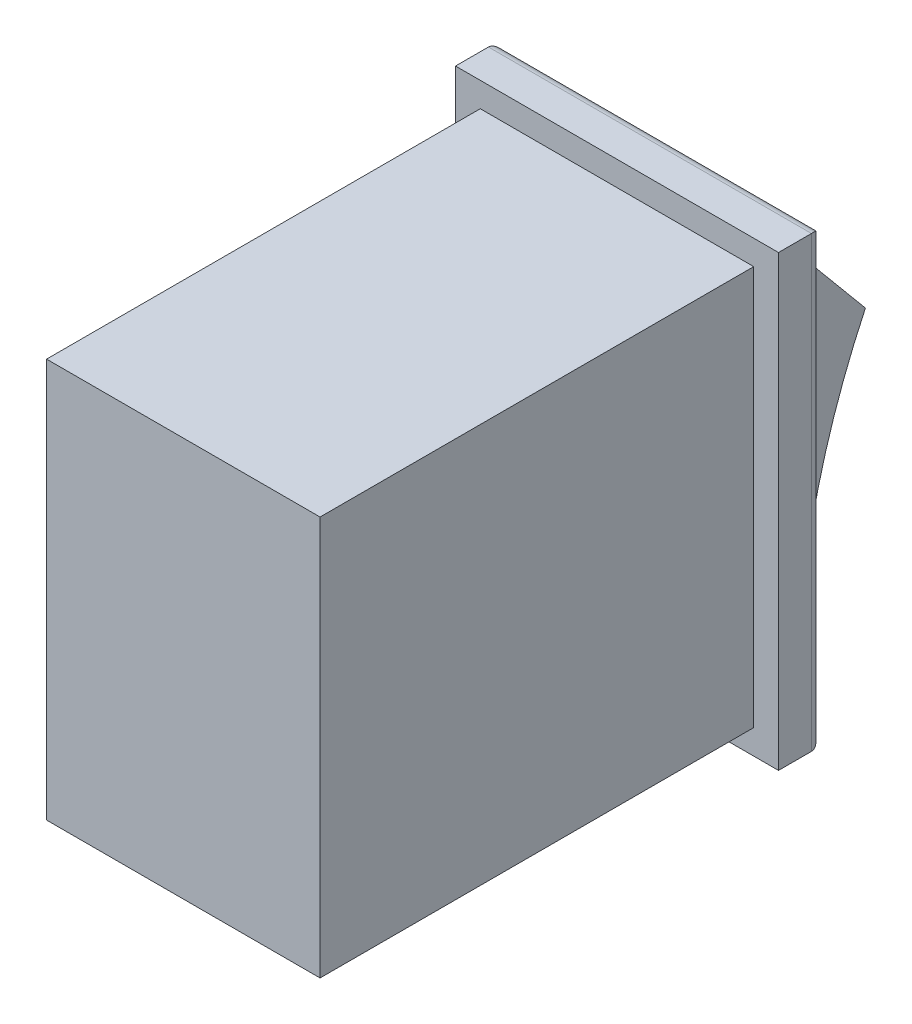
ISO-10303-21;
HEADER;
FILE_DESCRIPTION(('STEP AP214'),'2;1');
FILE_NAME('part.step','',(''),(''),'','','');
FILE_SCHEMA(('AUTOMOTIVE_DESIGN { 1 0 10303 214 1 1 1 1 }'));
ENDSEC;
DATA;
#1=APPLICATION_CONTEXT('core data for automotive mechanical design processes');
#2=APPLICATION_PROTOCOL_DEFINITION('international standard','automotive_design',2000,#1);
#3=PRODUCT_CONTEXT('',#1,'mechanical');
#4=PRODUCT('Part','Part','',(#3));
#5=PRODUCT_RELATED_PRODUCT_CATEGORY('part','',(#4));
#6=PRODUCT_DEFINITION_FORMATION('','',#4);
#7=PRODUCT_DEFINITION_CONTEXT('part definition',#1,'design');
#8=PRODUCT_DEFINITION('design','',#6,#7);
#9=PRODUCT_DEFINITION_SHAPE('','',#8);
#10=(LENGTH_UNIT() NAMED_UNIT(*) SI_UNIT(.MILLI.,.METRE.));
#11=(NAMED_UNIT(*) PLANE_ANGLE_UNIT() SI_UNIT($,.RADIAN.));
#12=(NAMED_UNIT(*) SI_UNIT($,.STERADIAN.) SOLID_ANGLE_UNIT());
#13=UNCERTAINTY_MEASURE_WITH_UNIT(LENGTH_MEASURE(1.E-05),#10,'distance_accuracy_value','');
#14=(GEOMETRIC_REPRESENTATION_CONTEXT(3) GLOBAL_UNCERTAINTY_ASSIGNED_CONTEXT((#13)) GLOBAL_UNIT_ASSIGNED_CONTEXT((#10,
#11,#12)) REPRESENTATION_CONTEXT('',''));
#15=CARTESIAN_POINT('',(0.,0.,0.));
#16=DIRECTION('',(0.,0.,1.));
#17=DIRECTION('',(1.,0.,0.));
#18=AXIS2_PLACEMENT_3D('',#15,#16,#17);
#19=CARTESIAN_POINT('',(13.85,-19.6875,-2.03));
#20=DIRECTION('',(0.,0.,-1.));
#21=DIRECTION('',(-1.,0.,0.));
#22=AXIS2_PLACEMENT_3D('',#19,#20,#21);
#23=PLANE('',#22);
#24=DIRECTION('',(0.,1.,0.));
#25=VECTOR('',#24,1.);
#26=CARTESIAN_POINT('',(-0.65,1.1425,-2.03));
#27=LINE('',#26,#25);
#28=CARTESIAN_POINT('',(-0.650000000000003,-19.1875,-2.03));
#29=VERTEX_POINT('',#28);
#30=CARTESIAN_POINT('',(-0.65,0.642500000000001,-2.03));
#31=VERTEX_POINT('',#30);
#32=EDGE_CURVE('E214',#29,#31,#27,.T.);
#33=ORIENTED_EDGE('',*,*,#32,.T.);
#34=DIRECTION('',(1.,0.,0.));
#35=VECTOR('',#34,1.);
#36=CARTESIAN_POINT('',(13.85,0.642500000000001,-2.03));
#37=LINE('',#36,#35);
#38=CARTESIAN_POINT('',(13.35,0.642500000000001,-2.03));
#39=VERTEX_POINT('',#38);
#40=EDGE_CURVE('E216',#31,#39,#37,.T.);
#41=ORIENTED_EDGE('',*,*,#40,.T.);
#42=DIRECTION('',(0.,-1.,0.));
#43=VECTOR('',#42,1.);
#44=CARTESIAN_POINT('',(13.35,-19.6875,-2.03));
#45=LINE('',#44,#43);
#46=CARTESIAN_POINT('',(13.35,-19.1875,-2.03));
#47=VERTEX_POINT('',#46);
#48=EDGE_CURVE('E210',#39,#47,#45,.T.);
#49=ORIENTED_EDGE('',*,*,#48,.T.);
#50=DIRECTION('',(-1.,0.,0.));
#51=VECTOR('',#50,1.);
#52=CARTESIAN_POINT('',(-1.15,-19.1875,-2.03));
#53=LINE('',#52,#51);
#54=EDGE_CURVE('E212',#47,#29,#53,.T.);
#55=ORIENTED_EDGE('',*,*,#54,.T.);
#56=EDGE_LOOP('',(#33,#41,#49,#55));
#57=FACE_BOUND('',#56,.T.);
#58=DIRECTION('',(-1.,0.,0.));
#59=VECTOR('',#58,1.);
#60=CARTESIAN_POINT('',(12.7,-18.2579762450133,-2.03));
#61=LINE('',#60,#59);
#62=CARTESIAN_POINT('',(12.7,-18.2579762450133,-2.03));
#63=VERTEX_POINT('',#62);
#64=CARTESIAN_POINT('',(0.,-18.2579762450133,-2.03));
#65=VERTEX_POINT('',#64);
#66=EDGE_CURVE('E44',#63,#65,#61,.T.);
#67=ORIENTED_EDGE('',*,*,#66,.F.);
#68=DIRECTION('',(0.,1.,0.));
#69=VECTOR('',#68,1.);
#70=CARTESIAN_POINT('',(12.7,-18.2579762450133,-2.03));
#71=LINE('',#70,#69);
#72=CARTESIAN_POINT('',(12.7,-0.473719642245536,-2.03));
#73=VERTEX_POINT('',#72);
#74=EDGE_CURVE('E48',#63,#73,#71,.T.);
#75=ORIENTED_EDGE('',*,*,#74,.T.);
#76=DIRECTION('',(-1.,0.,0.));
#77=VECTOR('',#76,1.);
#78=CARTESIAN_POINT('',(12.7,-0.473719642245534,-2.03));
#79=LINE('',#78,#77);
#80=CARTESIAN_POINT('',(0.,-0.473719642245535,-2.03));
#81=VERTEX_POINT('',#80);
#82=EDGE_CURVE('E118',#73,#81,#79,.T.);
#83=ORIENTED_EDGE('',*,*,#82,.T.);
#84=DIRECTION('',(0.,1.,0.));
#85=VECTOR('',#84,1.);
#86=CARTESIAN_POINT('',(0.,-18.2579762450133,-2.03));
#87=LINE('',#86,#85);
#88=EDGE_CURVE('E120',#65,#81,#87,.T.);
#89=ORIENTED_EDGE('',*,*,#88,.F.);
#90=EDGE_LOOP('',(#67,#75,#83,#89));
#91=FACE_BOUND('',#90,.T.);
#92=ADVANCED_FACE('F29',(#57,#91),#23,.T.);
#93=CARTESIAN_POINT('',(0.,0.,20.14));
#94=DIRECTION('',(1.,0.,0.));
#95=DIRECTION('',(0.,1.,0.));
#96=AXIS2_PLACEMENT_3D('',#93,#94,#95);
#97=PLANE('',#96);
#98=DIRECTION('',(0.,-1.,0.));
#99=VECTOR('',#98,1.);
#100=CARTESIAN_POINT('',(0.,0.,0.));
#101=LINE('',#100,#99);
#102=CARTESIAN_POINT('',(0.,0.,0.));
#103=VERTEX_POINT('',#102);
#104=CARTESIAN_POINT('',(0.,-18.54,0.));
#105=VERTEX_POINT('',#104);
#106=EDGE_CURVE('E177',#103,#105,#101,.T.);
#107=ORIENTED_EDGE('',*,*,#106,.T.);
#108=DIRECTION('',(0.,0.,-1.));
#109=VECTOR('',#108,1.);
#110=CARTESIAN_POINT('',(0.,-18.54,20.14));
#111=LINE('',#110,#109);
#112=CARTESIAN_POINT('',(0.,-18.54,20.14));
#113=VERTEX_POINT('',#112);
#114=EDGE_CURVE('E207',#113,#105,#111,.T.);
#115=ORIENTED_EDGE('',*,*,#114,.F.);
#116=DIRECTION('',(0.,-1.,0.));
#117=VECTOR('',#116,1.);
#118=CARTESIAN_POINT('',(0.,0.,20.14));
#119=LINE('',#118,#117);
#120=CARTESIAN_POINT('',(0.,0.,20.14));
#121=VERTEX_POINT('',#120);
#122=EDGE_CURVE('E189',#121,#113,#119,.T.);
#123=ORIENTED_EDGE('',*,*,#122,.F.);
#124=DIRECTION('',(0.,0.,-1.));
#125=VECTOR('',#124,1.);
#126=CARTESIAN_POINT('',(0.,0.,20.14));
#127=LINE('',#126,#125);
#128=EDGE_CURVE('E198',#121,#103,#127,.T.);
#129=ORIENTED_EDGE('',*,*,#128,.T.);
#130=EDGE_LOOP('',(#107,#115,#123,#129));
#131=FACE_BOUND('',#130,.T.);
#132=ADVANCED_FACE('F31',(#131),#97,.F.);
#133=CARTESIAN_POINT('',(0.,-18.54,20.14));
#134=DIRECTION('',(0.,1.,0.));
#135=DIRECTION('',(0.,0.,1.));
#136=AXIS2_PLACEMENT_3D('',#133,#134,#135);
#137=PLANE('',#136);
#138=DIRECTION('',(1.,0.,0.));
#139=VECTOR('',#138,1.);
#140=CARTESIAN_POINT('',(0.,-18.54,0.));
#141=LINE('',#140,#139);
#142=CARTESIAN_POINT('',(12.7,-18.54,0.));
#143=VERTEX_POINT('',#142);
#144=EDGE_CURVE('E180',#105,#143,#141,.T.);
#145=ORIENTED_EDGE('',*,*,#144,.T.);
#146=DIRECTION('',(0.,0.,-1.));
#147=VECTOR('',#146,1.);
#148=CARTESIAN_POINT('',(12.7,-18.54,20.14));
#149=LINE('',#148,#147);
#150=CARTESIAN_POINT('',(12.7,-18.54,20.14));
#151=VERTEX_POINT('',#150);
#152=EDGE_CURVE('E204',#151,#143,#149,.T.);
#153=ORIENTED_EDGE('',*,*,#152,.F.);
#154=DIRECTION('',(1.,0.,0.));
#155=VECTOR('',#154,1.);
#156=CARTESIAN_POINT('',(0.,-18.54,20.14));
#157=LINE('',#156,#155);
#158=EDGE_CURVE('E192',#113,#151,#157,.T.);
#159=ORIENTED_EDGE('',*,*,#158,.F.);
#160=ORIENTED_EDGE('',*,*,#114,.T.);
#161=EDGE_LOOP('',(#145,#153,#159,#160));
#162=FACE_BOUND('',#161,.T.);
#163=ADVANCED_FACE('F265',(#162),#137,.F.);
#164=CARTESIAN_POINT('',(12.7,0.,20.14));
#165=DIRECTION('',(-1.,0.,0.));
#166=DIRECTION('',(0.,-1.,0.));
#167=AXIS2_PLACEMENT_3D('',#164,#165,#166);
#168=PLANE('',#167);
#169=DIRECTION('',(0.,1.,0.));
#170=VECTOR('',#169,1.);
#171=CARTESIAN_POINT('',(12.7,0.,0.));
#172=LINE('',#171,#170);
#173=CARTESIAN_POINT('',(12.7,0.,0.));
#174=VERTEX_POINT('',#173);
#175=EDGE_CURVE('E183',#143,#174,#172,.T.);
#176=ORIENTED_EDGE('',*,*,#175,.T.);
#177=DIRECTION('',(0.,0.,-1.));
#178=VECTOR('',#177,1.);
#179=CARTESIAN_POINT('',(12.7,0.,20.14));
#180=LINE('',#179,#178);
#181=CARTESIAN_POINT('',(12.7,0.,20.14));
#182=VERTEX_POINT('',#181);
#183=EDGE_CURVE('E201',#182,#174,#180,.T.);
#184=ORIENTED_EDGE('',*,*,#183,.F.);
#185=DIRECTION('',(0.,1.,0.));
#186=VECTOR('',#185,1.);
#187=CARTESIAN_POINT('',(12.7,0.,20.14));
#188=LINE('',#187,#186);
#189=EDGE_CURVE('E194',#151,#182,#188,.T.);
#190=ORIENTED_EDGE('',*,*,#189,.F.);
#191=ORIENTED_EDGE('',*,*,#152,.T.);
#192=EDGE_LOOP('',(#176,#184,#190,#191));
#193=FACE_BOUND('',#192,.T.);
#194=ADVANCED_FACE('F274',(#193),#168,.F.);
#195=CARTESIAN_POINT('',(0.,0.,20.14));
#196=DIRECTION('',(0.,-1.,0.));
#197=DIRECTION('',(0.,0.,-1.));
#198=AXIS2_PLACEMENT_3D('',#195,#196,#197);
#199=PLANE('',#198);
#200=DIRECTION('',(-1.,0.,0.));
#201=VECTOR('',#200,1.);
#202=CARTESIAN_POINT('',(0.,0.,0.));
#203=LINE('',#202,#201);
#204=EDGE_CURVE('E186',#174,#103,#203,.T.);
#205=ORIENTED_EDGE('',*,*,#204,.T.);
#206=ORIENTED_EDGE('',*,*,#128,.F.);
#207=DIRECTION('',(-1.,0.,0.));
#208=VECTOR('',#207,1.);
#209=CARTESIAN_POINT('',(0.,0.,20.14));
#210=LINE('',#209,#208);
#211=EDGE_CURVE('E196',#182,#121,#210,.T.);
#212=ORIENTED_EDGE('',*,*,#211,.F.);
#213=ORIENTED_EDGE('',*,*,#183,.T.);
#214=EDGE_LOOP('',(#205,#206,#212,#213));
#215=FACE_BOUND('',#214,.T.);
#216=ADVANCED_FACE('F271',(#215),#199,.F.);
#217=CARTESIAN_POINT('',(0.,-18.54,20.14));
#218=DIRECTION('',(0.,0.,1.));
#219=DIRECTION('',(1.,0.,0.));
#220=AXIS2_PLACEMENT_3D('',#217,#218,#219);
#221=PLANE('',#220);
#222=ORIENTED_EDGE('',*,*,#122,.T.);
#223=ORIENTED_EDGE('',*,*,#158,.T.);
#224=ORIENTED_EDGE('',*,*,#189,.T.);
#225=ORIENTED_EDGE('',*,*,#211,.T.);
#226=EDGE_LOOP('',(#222,#223,#224,#225));
#227=FACE_BOUND('',#226,.T.);
#228=ADVANCED_FACE('F260',(#227),#221,.T.);
#229=CARTESIAN_POINT('',(13.85,-19.6875,0.));
#230=DIRECTION('',(0.,0.,-1.));
#231=DIRECTION('',(-1.,0.,0.));
#232=AXIS2_PLACEMENT_3D('',#229,#230,#231);
#233=PLANE('',#232);
#234=DIRECTION('',(0.,-1.,0.));
#235=VECTOR('',#234,1.);
#236=CARTESIAN_POINT('',(13.85,1.1425,0.));
#237=LINE('',#236,#235);
#238=CARTESIAN_POINT('',(13.85,1.1425,0.));
#239=VERTEX_POINT('',#238);
#240=CARTESIAN_POINT('',(13.85,-19.6875,0.));
#241=VERTEX_POINT('',#240);
#242=EDGE_CURVE('E157',#239,#241,#237,.T.);
#243=ORIENTED_EDGE('',*,*,#242,.F.);
#244=DIRECTION('',(1.,0.,0.));
#245=VECTOR('',#244,1.);
#246=CARTESIAN_POINT('',(13.85,1.1425,0.));
#247=LINE('',#246,#245);
#248=CARTESIAN_POINT('',(-1.15,1.1425,0.));
#249=VERTEX_POINT('',#248);
#250=EDGE_CURVE('E166',#249,#239,#247,.T.);
#251=ORIENTED_EDGE('',*,*,#250,.F.);
#252=DIRECTION('',(0.,1.,0.));
#253=VECTOR('',#252,1.);
#254=CARTESIAN_POINT('',(-1.15,1.1425,0.));
#255=LINE('',#254,#253);
#256=CARTESIAN_POINT('',(-1.15,-19.6875,0.));
#257=VERTEX_POINT('',#256);
#258=EDGE_CURVE('E163',#257,#249,#255,.T.);
#259=ORIENTED_EDGE('',*,*,#258,.F.);
#260=DIRECTION('',(-1.,0.,0.));
#261=VECTOR('',#260,1.);
#262=CARTESIAN_POINT('',(13.85,-19.6875,0.));
#263=LINE('',#262,#261);
#264=EDGE_CURVE('E160',#241,#257,#263,.T.);
#265=ORIENTED_EDGE('',*,*,#264,.F.);
#266=EDGE_LOOP('',(#243,#251,#259,#265));
#267=FACE_BOUND('',#266,.T.);
#268=ORIENTED_EDGE('',*,*,#144,.F.);
#269=ORIENTED_EDGE('',*,*,#106,.F.);
#270=ORIENTED_EDGE('',*,*,#204,.F.);
#271=ORIENTED_EDGE('',*,*,#175,.F.);
#272=EDGE_LOOP('',(#268,#269,#270,#271));
#273=FACE_BOUND('',#272,.T.);
#274=ADVANCED_FACE('F257',(#267,#273),#233,.F.);
#275=CARTESIAN_POINT('',(13.85,1.1425,-2.03));
#276=DIRECTION('',(-1.,0.,0.));
#277=DIRECTION('',(0.,-1.,0.));
#278=AXIS2_PLACEMENT_3D('',#275,#276,#277);
#279=PLANE('',#278);
#280=DIRECTION('',(0.,0.,1.));
#281=VECTOR('',#280,1.);
#282=CARTESIAN_POINT('',(13.85,-19.6875,-2.03));
#283=LINE('',#282,#281);
#284=CARTESIAN_POINT('',(13.85,-19.6875,-1.53));
#285=VERTEX_POINT('',#284);
#286=EDGE_CURVE('E175',#285,#241,#283,.T.);
#287=ORIENTED_EDGE('',*,*,#286,.F.);
#288=DIRECTION('',(0.,-1.,0.));
#289=VECTOR('',#288,1.);
#290=CARTESIAN_POINT('',(13.85,1.1425,-1.53));
#291=LINE('',#290,#289);
#292=CARTESIAN_POINT('',(13.85,1.1425,-1.53));
#293=VERTEX_POINT('',#292);
#294=EDGE_CURVE('E11',#285,#293,#291,.F.);
#295=ORIENTED_EDGE('',*,*,#294,.T.);
#296=DIRECTION('',(0.,0.,1.));
#297=VECTOR('',#296,1.);
#298=CARTESIAN_POINT('',(13.85,1.1425,-2.03));
#299=LINE('',#298,#297);
#300=EDGE_CURVE('E169',#293,#239,#299,.T.);
#301=ORIENTED_EDGE('',*,*,#300,.T.);
#302=ORIENTED_EDGE('',*,*,#242,.T.);
#303=EDGE_LOOP('',(#287,#295,#301,#302));
#304=FACE_BOUND('',#303,.T.);
#305=ADVANCED_FACE('F233',(#304),#279,.F.);
#306=CARTESIAN_POINT('',(13.85,-19.6875,-2.03));
#307=DIRECTION('',(0.,1.,0.));
#308=DIRECTION('',(0.,0.,1.));
#309=AXIS2_PLACEMENT_3D('',#306,#307,#308);
#310=PLANE('',#309);
#311=DIRECTION('',(0.,0.,1.));
#312=VECTOR('',#311,1.);
#313=CARTESIAN_POINT('',(-1.15,-19.6875,-2.03));
#314=LINE('',#313,#312);
#315=CARTESIAN_POINT('',(-1.15,-19.6875,-1.53));
#316=VERTEX_POINT('',#315);
#317=EDGE_CURVE('E173',#316,#257,#314,.T.);
#318=ORIENTED_EDGE('',*,*,#317,.F.);
#319=DIRECTION('',(-1.,0.,0.));
#320=VECTOR('',#319,1.);
#321=CARTESIAN_POINT('',(13.85,-19.6875,-1.53));
#322=LINE('',#321,#320);
#323=EDGE_CURVE('E37',#316,#285,#322,.F.);
#324=ORIENTED_EDGE('',*,*,#323,.T.);
#325=ORIENTED_EDGE('',*,*,#286,.T.);
#326=ORIENTED_EDGE('',*,*,#264,.T.);
#327=EDGE_LOOP('',(#318,#324,#325,#326));
#328=FACE_BOUND('',#327,.T.);
#329=ADVANCED_FACE('F227',(#328),#310,.F.);
#330=CARTESIAN_POINT('',(-1.15,1.1425,-2.03));
#331=DIRECTION('',(1.,0.,0.));
#332=DIRECTION('',(0.,1.,0.));
#333=AXIS2_PLACEMENT_3D('',#330,#331,#332);
#334=PLANE('',#333);
#335=DIRECTION('',(0.,0.,1.));
#336=VECTOR('',#335,1.);
#337=CARTESIAN_POINT('',(-1.15,1.1425,-2.03));
#338=LINE('',#337,#336);
#339=CARTESIAN_POINT('',(-1.15,1.1425,-1.53));
#340=VERTEX_POINT('',#339);
#341=EDGE_CURVE('E171',#340,#249,#338,.T.);
#342=ORIENTED_EDGE('',*,*,#341,.F.);
#343=DIRECTION('',(0.,1.,0.));
#344=VECTOR('',#343,1.);
#345=CARTESIAN_POINT('',(-1.15,-19.6875,-1.53));
#346=LINE('',#345,#344);
#347=EDGE_CURVE('E222',#340,#316,#346,.F.);
#348=ORIENTED_EDGE('',*,*,#347,.T.);
#349=ORIENTED_EDGE('',*,*,#317,.T.);
#350=ORIENTED_EDGE('',*,*,#258,.T.);
#351=EDGE_LOOP('',(#342,#348,#349,#350));
#352=FACE_BOUND('',#351,.T.);
#353=ADVANCED_FACE('F253',(#352),#334,.F.);
#354=CARTESIAN_POINT('',(13.85,1.1425,-2.03));
#355=DIRECTION('',(0.,-1.,0.));
#356=DIRECTION('',(0.,0.,-1.));
#357=AXIS2_PLACEMENT_3D('',#354,#355,#356);
#358=PLANE('',#357);
#359=ORIENTED_EDGE('',*,*,#300,.F.);
#360=DIRECTION('',(1.,0.,0.));
#361=VECTOR('',#360,1.);
#362=CARTESIAN_POINT('',(-1.15,1.1425,-1.53));
#363=LINE('',#362,#361);
#364=EDGE_CURVE('E219',#293,#340,#363,.F.);
#365=ORIENTED_EDGE('',*,*,#364,.T.);
#366=ORIENTED_EDGE('',*,*,#341,.T.);
#367=ORIENTED_EDGE('',*,*,#250,.T.);
#368=EDGE_LOOP('',(#359,#365,#366,#367));
#369=FACE_BOUND('',#368,.T.);
#370=ADVANCED_FACE('F251',(#369),#358,.F.);
#371=CARTESIAN_POINT('',(13.85,-19.1875,-1.53));
#372=DIRECTION('',(1.,0.,0.));
#373=DIRECTION('',(0.,0.,-1.));
#374=AXIS2_PLACEMENT_3D('',#371,#372,#373);
#375=CYLINDRICAL_SURFACE('',#374,0.5);
#376=CARTESIAN_POINT('',(13.35,-19.1875,-1.53));
#377=DIRECTION('',(0.707106781186548,0.707106781186547,0.));
#378=DIRECTION('',(-0.707106781186547,0.707106781186548,0.));
#379=AXIS2_PLACEMENT_3D('',#376,#377,#378);
#380=ELLIPSE('',#379,0.707106781186547,0.5);
#381=EDGE_CURVE('E151',#285,#47,#380,.T.);
#382=ORIENTED_EDGE('',*,*,#381,.F.);
#383=ORIENTED_EDGE('',*,*,#323,.F.);
#384=CARTESIAN_POINT('',(-0.650000000000003,-19.1875,-1.53));
#385=DIRECTION('',(0.707106781186547,-0.707106781186548,0.));
#386=DIRECTION('',(0.707106781186548,0.707106781186547,0.));
#387=AXIS2_PLACEMENT_3D('',#384,#385,#386);
#388=ELLIPSE('',#387,0.707106781186548,0.5);
#389=EDGE_CURVE('E154',#29,#316,#388,.F.);
#390=ORIENTED_EDGE('',*,*,#389,.F.);
#391=ORIENTED_EDGE('',*,*,#54,.F.);
#392=EDGE_LOOP('',(#382,#383,#390,#391));
#393=FACE_BOUND('',#392,.T.);
#394=ADVANCED_FACE('F238',(#393),#375,.T.);
#395=CARTESIAN_POINT('',(-0.650000000000003,-19.6875,-1.53));
#396=DIRECTION('',(0.,-1.,0.));
#397=DIRECTION('',(1.,0.,0.));
#398=AXIS2_PLACEMENT_3D('',#395,#396,#397);
#399=CYLINDRICAL_SURFACE('',#398,0.5);
#400=ORIENTED_EDGE('',*,*,#389,.T.);
#401=ORIENTED_EDGE('',*,*,#347,.F.);
#402=CARTESIAN_POINT('',(-0.65,0.642500000000001,-1.53));
#403=DIRECTION('',(-0.707106781186548,-0.707106781186547,0.));
#404=DIRECTION('',(0.707106781186547,-0.707106781186548,0.));
#405=AXIS2_PLACEMENT_3D('',#402,#403,#404);
#406=ELLIPSE('',#405,0.707106781186547,0.5);
#407=EDGE_CURVE('E149',#31,#340,#406,.F.);
#408=ORIENTED_EDGE('',*,*,#407,.F.);
#409=ORIENTED_EDGE('',*,*,#32,.F.);
#410=EDGE_LOOP('',(#400,#401,#408,#409));
#411=FACE_BOUND('',#410,.T.);
#412=ADVANCED_FACE('F320',(#411),#399,.T.);
#413=CARTESIAN_POINT('',(13.35,-19.6875,-1.53));
#414=DIRECTION('',(0.,1.,0.));
#415=DIRECTION('',(-1.,0.,0.));
#416=AXIS2_PLACEMENT_3D('',#413,#414,#415);
#417=CYLINDRICAL_SURFACE('',#416,0.5);
#418=ORIENTED_EDGE('',*,*,#381,.T.);
#419=ORIENTED_EDGE('',*,*,#48,.F.);
#420=CARTESIAN_POINT('',(13.35,0.642500000000001,-1.53));
#421=DIRECTION('',(-0.707106781186547,0.707106781186548,0.));
#422=DIRECTION('',(0.707106781186548,0.707106781186547,0.));
#423=AXIS2_PLACEMENT_3D('',#420,#421,#422);
#424=ELLIPSE('',#423,0.707106781186548,0.5);
#425=EDGE_CURVE('E145',#293,#39,#424,.T.);
#426=ORIENTED_EDGE('',*,*,#425,.F.);
#427=ORIENTED_EDGE('',*,*,#294,.F.);
#428=EDGE_LOOP('',(#418,#419,#426,#427));
#429=FACE_BOUND('',#428,.T.);
#430=ADVANCED_FACE('F242',(#429),#417,.T.);
#431=CARTESIAN_POINT('',(13.85,0.642500000000001,-1.53));
#432=DIRECTION('',(-1.,0.,0.));
#433=DIRECTION('',(0.,0.,1.));
#434=AXIS2_PLACEMENT_3D('',#431,#432,#433);
#435=CYLINDRICAL_SURFACE('',#434,0.5);
#436=ORIENTED_EDGE('',*,*,#407,.T.);
#437=ORIENTED_EDGE('',*,*,#364,.F.);
#438=ORIENTED_EDGE('',*,*,#425,.T.);
#439=ORIENTED_EDGE('',*,*,#40,.F.);
#440=EDGE_LOOP('',(#436,#437,#438,#439));
#441=FACE_BOUND('',#440,.T.);
#442=ADVANCED_FACE('F246',(#441),#435,.T.);
#443=CARTESIAN_POINT('',(12.7,-18.2579762450133,-34.6576199548254));
#444=DIRECTION('',(-1.,0.,0.));
#445=DIRECTION('',(0.,-1.,0.));
#446=AXIS2_PLACEMENT_3D('',#443,#444,#445);
#447=CYLINDRICAL_SURFACE('',#446,32.6276199548254);
#448=CARTESIAN_POINT('',(0.,-18.2579762450133,-34.6576199548254));
#449=DIRECTION('',(1.,0.,0.));
#450=DIRECTION('',(0.,-1.,0.));
#451=AXIS2_PLACEMENT_3D('',#448,#449,#450);
#452=CIRCLE('',#451,32.6276199548254);
#453=CARTESIAN_POINT('',(0.,-4.25820944731453,-5.1861402918263));
#454=VERTEX_POINT('',#453);
#455=EDGE_CURVE('E133',#454,#65,#452,.T.);
#456=ORIENTED_EDGE('',*,*,#455,.F.);
#457=DIRECTION('',(-1.,0.,0.));
#458=VECTOR('',#457,1.);
#459=CARTESIAN_POINT('',(12.7,-4.25820944731452,-5.1861402918263));
#460=LINE('',#459,#458);
#461=CARTESIAN_POINT('',(12.7,-4.25820944731452,-5.1861402918263));
#462=VERTEX_POINT('',#461);
#463=EDGE_CURVE('E125',#462,#454,#460,.T.);
#464=ORIENTED_EDGE('',*,*,#463,.F.);
#465=CARTESIAN_POINT('',(12.7,-18.2579762450133,-34.6576199548254));
#466=DIRECTION('',(1.,0.,0.));
#467=DIRECTION('',(0.,-1.,0.));
#468=AXIS2_PLACEMENT_3D('',#465,#466,#467);
#469=CIRCLE('',#468,32.6276199548254);
#470=EDGE_CURVE('E136',#462,#63,#469,.T.);
#471=ORIENTED_EDGE('',*,*,#470,.T.);
#472=ORIENTED_EDGE('',*,*,#66,.T.);
#473=EDGE_LOOP('',(#456,#464,#471,#472));
#474=FACE_BOUND('',#473,.T.);
#475=ADVANCED_FACE('F339',(#474),#447,.F.);
#476=CARTESIAN_POINT('',(12.7,-0.473719642245534,-2.03));
#477=DIRECTION('',(0.,0.640471636668648,-0.767981824409265));
#478=DIRECTION('',(0.,0.767981824409265,0.640471636668648));
#479=AXIS2_PLACEMENT_3D('',#476,#477,#478);
#480=PLANE('',#479);
#481=DIRECTION('',(0.,-0.767981824409265,-0.640471636668648));
#482=VECTOR('',#481,1.);
#483=CARTESIAN_POINT('',(0.,-0.473719642245535,-2.03));
#484=LINE('',#483,#482);
#485=EDGE_CURVE('E131',#81,#454,#484,.T.);
#486=ORIENTED_EDGE('',*,*,#485,.F.);
#487=ORIENTED_EDGE('',*,*,#82,.F.);
#488=DIRECTION('',(0.,-0.767981824409265,-0.640471636668648));
#489=VECTOR('',#488,1.);
#490=CARTESIAN_POINT('',(12.7,-0.473719642245534,-2.03));
#491=LINE('',#490,#489);
#492=EDGE_CURVE('E143',#73,#462,#491,.T.);
#493=ORIENTED_EDGE('',*,*,#492,.T.);
#494=ORIENTED_EDGE('',*,*,#463,.T.);
#495=EDGE_LOOP('',(#486,#487,#493,#494));
#496=FACE_BOUND('',#495,.T.);
#497=ADVANCED_FACE('F135',(#496),#480,.T.);
#498=CARTESIAN_POINT('',(12.7,-18.2579762450133,-34.6576199548254));
#499=DIRECTION('',(-1.,0.,0.));
#500=DIRECTION('',(0.,-1.,0.));
#501=AXIS2_PLACEMENT_3D('',#498,#499,#500);
#502=PLANE('',#501);
#503=ORIENTED_EDGE('',*,*,#470,.F.);
#504=ORIENTED_EDGE('',*,*,#492,.F.);
#505=ORIENTED_EDGE('',*,*,#74,.F.);
#506=EDGE_LOOP('',(#503,#504,#505));
#507=FACE_BOUND('',#506,.T.);
#508=ADVANCED_FACE('F353',(#507),#502,.F.);
#509=CARTESIAN_POINT('',(0.,-18.2579762450133,-34.6576199548254));
#510=DIRECTION('',(-1.,0.,0.));
#511=DIRECTION('',(0.,-1.,0.));
#512=AXIS2_PLACEMENT_3D('',#509,#510,#511);
#513=PLANE('',#512);
#514=ORIENTED_EDGE('',*,*,#455,.T.);
#515=ORIENTED_EDGE('',*,*,#88,.T.);
#516=ORIENTED_EDGE('',*,*,#485,.T.);
#517=EDGE_LOOP('',(#514,#515,#516));
#518=FACE_BOUND('',#517,.T.);
#519=ADVANCED_FACE('F130',(#518),#513,.T.);
#520=CLOSED_SHELL('',(#92,#132,#163,#194,#216,#228,#274,#305,#329,#353,#370,#394,#412,#430,#442,
#475,#497,#508,#519));
#521=MANIFOLD_SOLID_BREP('B2',#520);
#522=ADVANCED_BREP_SHAPE_REPRESENTATION('',(#18,#521),#14);
#523=SHAPE_DEFINITION_REPRESENTATION(#9,#522);
ENDSEC;
END-ISO-10303-21;
